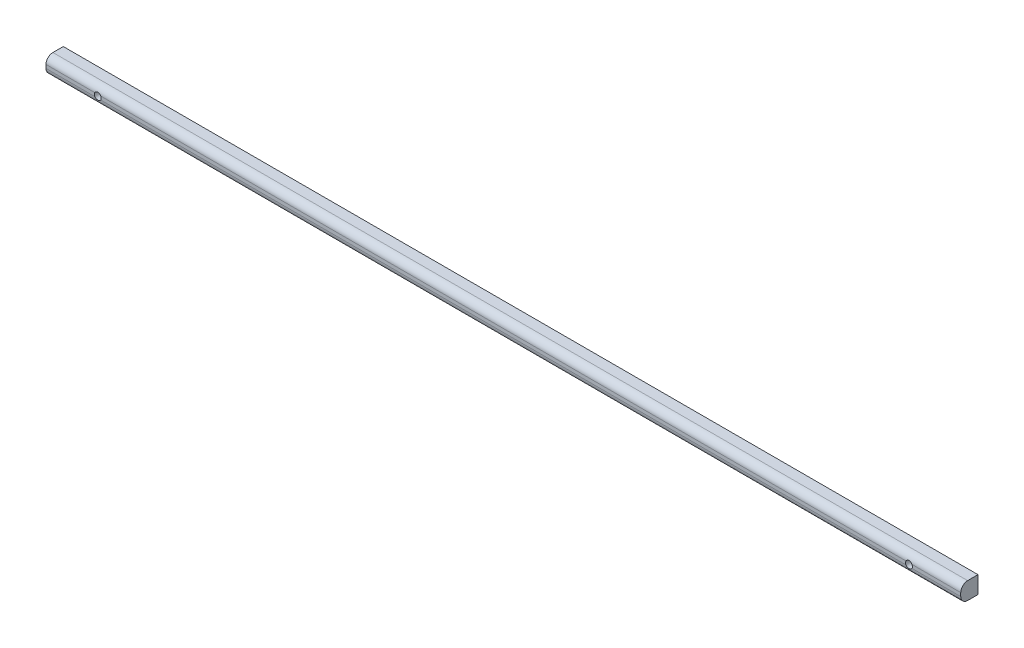
ISO-10303-21;
HEADER;
FILE_DESCRIPTION(('STEP AP214'),'2;1');
FILE_NAME('part.step','',(''),(''),'','','');
FILE_SCHEMA(('AUTOMOTIVE_DESIGN { 1 0 10303 214 1 1 1 1 }'));
ENDSEC;
DATA;
#1=APPLICATION_CONTEXT('core data for automotive mechanical design processes');
#2=APPLICATION_PROTOCOL_DEFINITION('international standard','automotive_design',2000,#1);
#3=PRODUCT_CONTEXT('',#1,'mechanical');
#4=PRODUCT('Part','Part','',(#3));
#5=PRODUCT_RELATED_PRODUCT_CATEGORY('part','',(#4));
#6=PRODUCT_DEFINITION_FORMATION('','',#4);
#7=PRODUCT_DEFINITION_CONTEXT('part definition',#1,'design');
#8=PRODUCT_DEFINITION('design','',#6,#7);
#9=PRODUCT_DEFINITION_SHAPE('','',#8);
#10=(LENGTH_UNIT() NAMED_UNIT(*) SI_UNIT(.MILLI.,.METRE.));
#11=(NAMED_UNIT(*) PLANE_ANGLE_UNIT() SI_UNIT($,.RADIAN.));
#12=(NAMED_UNIT(*) SI_UNIT($,.STERADIAN.) SOLID_ANGLE_UNIT());
#13=UNCERTAINTY_MEASURE_WITH_UNIT(LENGTH_MEASURE(1.E-05),#10,'distance_accuracy_value','');
#14=(GEOMETRIC_REPRESENTATION_CONTEXT(3) GLOBAL_UNCERTAINTY_ASSIGNED_CONTEXT((#13)) GLOBAL_UNIT_ASSIGNED_CONTEXT((#10,
#11,#12)) REPRESENTATION_CONTEXT('',''));
#15=CARTESIAN_POINT('',(0.,0.,0.));
#16=DIRECTION('',(0.,0.,1.));
#17=DIRECTION('',(1.,0.,0.));
#18=AXIS2_PLACEMENT_3D('',#15,#16,#17);
#19=CARTESIAN_POINT('',(0.,0.,5.));
#20=DIRECTION('',(0.,0.,1.));
#21=DIRECTION('',(1.,0.,0.));
#22=AXIS2_PLACEMENT_3D('',#19,#20,#21);
#23=PLANE('',#22);
#24=DIRECTION('',(0.,-1.,0.));
#25=VECTOR('',#24,1.);
#26=CARTESIAN_POINT('',(-265.,0.,5.));
#27=LINE('',#26,#25);
#28=CARTESIAN_POINT('',(-265.,3.,5.));
#29=VERTEX_POINT('',#28);
#30=CARTESIAN_POINT('',(-265.,2.,5.));
#31=VERTEX_POINT('',#30);
#32=EDGE_CURVE('E142',#29,#31,#27,.T.);
#33=ORIENTED_EDGE('',*,*,#32,.T.);
#34=DIRECTION('',(1.,0.,0.));
#35=VECTOR('',#34,1.);
#36=CARTESIAN_POINT('',(0.,2.,5.));
#37=LINE('',#36,#35);
#38=CARTESIAN_POINT('',(-250.866025403784,2.,5.));
#39=VERTEX_POINT('',#38);
#40=EDGE_CURVE('E163',#31,#39,#37,.T.);
#41=ORIENTED_EDGE('',*,*,#40,.T.);
#42=CARTESIAN_POINT('',(-250.,2.5,5.));
#43=DIRECTION('',(0.,0.,1.));
#44=DIRECTION('',(1.,0.,0.));
#45=AXIS2_PLACEMENT_3D('',#42,#43,#44);
#46=CIRCLE('',#45,0.999999999999998);
#47=CARTESIAN_POINT('',(-250.866025403784,3.00000000000001,5.));
#48=VERTEX_POINT('',#47);
#49=EDGE_CURVE('E139',#48,#39,#46,.T.);
#50=ORIENTED_EDGE('',*,*,#49,.F.);
#51=DIRECTION('',(-1.,0.,0.));
#52=VECTOR('',#51,1.);
#53=CARTESIAN_POINT('',(-265.,3.,5.));
#54=LINE('',#53,#52);
#55=EDGE_CURVE('E121',#48,#29,#54,.T.);
#56=ORIENTED_EDGE('',*,*,#55,.T.);
#57=EDGE_LOOP('',(#33,#41,#50,#56));
#58=FACE_BOUND('',#57,.T.);
#59=ADVANCED_FACE('F33',(#58),#23,.T.);
#60=CARTESIAN_POINT('',(-249.133974596216,2.,5.));
#61=VERTEX_POINT('',#60);
#62=CARTESIAN_POINT('',(-249.133974596216,3.,5.));
#63=VERTEX_POINT('',#62);
#64=EDGE_CURVE('E259',#61,#63,#46,.T.);
#65=ORIENTED_EDGE('',*,*,#64,.F.);
#66=DIRECTION('',(1.,0.,0.));
#67=VECTOR('',#66,1.);
#68=CARTESIAN_POINT('',(0.,2.,5.));
#69=LINE('',#68,#67);
#70=CARTESIAN_POINT('',(-15.8660254037844,2.,5.));
#71=VERTEX_POINT('',#70);
#72=EDGE_CURVE('E161',#61,#71,#69,.T.);
#73=ORIENTED_EDGE('',*,*,#72,.T.);
#74=CARTESIAN_POINT('',(-15.,2.5,5.));
#75=DIRECTION('',(0.,0.,1.));
#76=DIRECTION('',(-1.,0.,0.));
#77=AXIS2_PLACEMENT_3D('',#74,#75,#76);
#78=CIRCLE('',#77,0.999999999999998);
#79=CARTESIAN_POINT('',(-15.8660254037844,3.00000000000006,5.));
#80=VERTEX_POINT('',#79);
#81=EDGE_CURVE('E251',#80,#71,#78,.T.);
#82=ORIENTED_EDGE('',*,*,#81,.F.);
#83=DIRECTION('',(-1.,0.,0.));
#84=VECTOR('',#83,1.);
#85=CARTESIAN_POINT('',(-265.,3.,5.));
#86=LINE('',#85,#84);
#87=EDGE_CURVE('E154',#80,#63,#86,.T.);
#88=ORIENTED_EDGE('',*,*,#87,.T.);
#89=EDGE_LOOP('',(#65,#73,#82,#88));
#90=FACE_BOUND('',#89,.T.);
#91=ADVANCED_FACE('F215',(#90),#23,.T.);
#92=CARTESIAN_POINT('',(0.,0.,5.));
#93=DIRECTION('',(-1.,0.,0.));
#94=DIRECTION('',(0.,-1.,0.));
#95=AXIS2_PLACEMENT_3D('',#92,#93,#94);
#96=PLANE('',#95);
#97=DIRECTION('',(0.,1.,0.));
#98=VECTOR('',#97,1.);
#99=CARTESIAN_POINT('',(0.,0.,5.));
#100=LINE('',#99,#98);
#101=CARTESIAN_POINT('',(0.,2.,5.));
#102=VERTEX_POINT('',#101);
#103=CARTESIAN_POINT('',(0.,3.00000000000006,5.));
#104=VERTEX_POINT('',#103);
#105=EDGE_CURVE('E148',#102,#104,#100,.T.);
#106=ORIENTED_EDGE('',*,*,#105,.F.);
#107=CARTESIAN_POINT('',(0.,2.,3.));
#108=DIRECTION('',(-1.,0.,0.));
#109=DIRECTION('',(0.,-1.,0.));
#110=AXIS2_PLACEMENT_3D('',#107,#108,#109);
#111=CIRCLE('',#110,2.);
#112=CARTESIAN_POINT('',(0.,0.,3.));
#113=VERTEX_POINT('',#112);
#114=EDGE_CURVE('E267',#102,#113,#111,.F.);
#115=ORIENTED_EDGE('',*,*,#114,.T.);
#116=DIRECTION('',(0.,0.,-1.));
#117=VECTOR('',#116,1.);
#118=CARTESIAN_POINT('',(0.,0.,5.));
#119=LINE('',#118,#117);
#120=CARTESIAN_POINT('',(0.,0.,0.));
#121=VERTEX_POINT('',#120);
#122=EDGE_CURVE('E134',#113,#121,#119,.T.);
#123=ORIENTED_EDGE('',*,*,#122,.T.);
#124=DIRECTION('',(0.,1.,0.));
#125=VECTOR('',#124,1.);
#126=CARTESIAN_POINT('',(0.,0.,0.));
#127=LINE('',#126,#125);
#128=CARTESIAN_POINT('',(0.,5.00000000000006,0.));
#129=VERTEX_POINT('',#128);
#130=EDGE_CURVE('E128',#121,#129,#127,.T.);
#131=ORIENTED_EDGE('',*,*,#130,.T.);
#132=DIRECTION('',(0.,0.,-1.));
#133=VECTOR('',#132,1.);
#134=CARTESIAN_POINT('',(0.,5.00000000000006,5.));
#135=LINE('',#134,#133);
#136=CARTESIAN_POINT('',(0.,5.00000000000006,3.));
#137=VERTEX_POINT('',#136);
#138=EDGE_CURVE('E112',#137,#129,#135,.T.);
#139=ORIENTED_EDGE('',*,*,#138,.F.);
#140=CARTESIAN_POINT('',(0.,3.00000000000006,3.));
#141=DIRECTION('',(-1.,0.,0.));
#142=DIRECTION('',(0.,-1.,0.));
#143=AXIS2_PLACEMENT_3D('',#140,#141,#142);
#144=CIRCLE('',#143,2.);
#145=EDGE_CURVE('E206',#137,#104,#144,.F.);
#146=ORIENTED_EDGE('',*,*,#145,.T.);
#147=EDGE_LOOP('',(#106,#115,#123,#131,#139,#146));
#148=FACE_BOUND('',#147,.T.);
#149=ADVANCED_FACE('F133',(#148),#96,.F.);
#150=CARTESIAN_POINT('',(0.,5.00000000000006,5.));
#151=DIRECTION('',(0.,-1.,0.));
#152=DIRECTION('',(1.,0.,0.));
#153=AXIS2_PLACEMENT_3D('',#150,#151,#152);
#154=PLANE('',#153);
#155=DIRECTION('',(0.,0.,-1.));
#156=VECTOR('',#155,1.);
#157=CARTESIAN_POINT('',(-265.,5.,5.));
#158=LINE('',#157,#156);
#159=CARTESIAN_POINT('',(-265.,5.,3.));
#160=VERTEX_POINT('',#159);
#161=CARTESIAN_POINT('',(-265.,5.,0.));
#162=VERTEX_POINT('',#161);
#163=EDGE_CURVE('E122',#160,#162,#158,.T.);
#164=ORIENTED_EDGE('',*,*,#163,.F.);
#165=DIRECTION('',(-1.,0.,0.));
#166=VECTOR('',#165,1.);
#167=CARTESIAN_POINT('',(0.,5.00000000000006,3.));
#168=LINE('',#167,#166);
#169=EDGE_CURVE('E11',#160,#137,#168,.F.);
#170=ORIENTED_EDGE('',*,*,#169,.T.);
#171=ORIENTED_EDGE('',*,*,#138,.T.);
#172=DIRECTION('',(-1.,0.,0.));
#173=VECTOR('',#172,1.);
#174=CARTESIAN_POINT('',(0.,5.00000000000006,0.));
#175=LINE('',#174,#173);
#176=EDGE_CURVE('E115',#129,#162,#175,.T.);
#177=ORIENTED_EDGE('',*,*,#176,.T.);
#178=EDGE_LOOP('',(#164,#170,#171,#177));
#179=FACE_BOUND('',#178,.T.);
#180=ADVANCED_FACE('F114',(#179),#154,.F.);
#181=CARTESIAN_POINT('',(-265.,0.,5.));
#182=DIRECTION('',(1.,0.,0.));
#183=DIRECTION('',(0.,0.,-1.));
#184=AXIS2_PLACEMENT_3D('',#181,#182,#183);
#185=PLANE('',#184);
#186=DIRECTION('',(0.,0.,-1.));
#187=VECTOR('',#186,1.);
#188=CARTESIAN_POINT('',(-265.,0.,5.));
#189=LINE('',#188,#187);
#190=CARTESIAN_POINT('',(-265.,0.,3.));
#191=VERTEX_POINT('',#190);
#192=CARTESIAN_POINT('',(-265.,0.,0.));
#193=VERTEX_POINT('',#192);
#194=EDGE_CURVE('E150',#191,#193,#189,.T.);
#195=ORIENTED_EDGE('',*,*,#194,.F.);
#196=CARTESIAN_POINT('',(-265.,2.,3.));
#197=DIRECTION('',(1.,0.,0.));
#198=DIRECTION('',(0.,0.,-1.));
#199=AXIS2_PLACEMENT_3D('',#196,#197,#198);
#200=CIRCLE('',#199,2.);
#201=EDGE_CURVE('E42',#191,#31,#200,.F.);
#202=ORIENTED_EDGE('',*,*,#201,.T.);
#203=ORIENTED_EDGE('',*,*,#32,.F.);
#204=CARTESIAN_POINT('',(-265.,3.,3.));
#205=DIRECTION('',(1.,0.,0.));
#206=DIRECTION('',(0.,0.,-1.));
#207=AXIS2_PLACEMENT_3D('',#204,#205,#206);
#208=CIRCLE('',#207,2.);
#209=EDGE_CURVE('E49',#29,#160,#208,.F.);
#210=ORIENTED_EDGE('',*,*,#209,.T.);
#211=ORIENTED_EDGE('',*,*,#163,.T.);
#212=DIRECTION('',(0.,-1.,0.));
#213=VECTOR('',#212,1.);
#214=CARTESIAN_POINT('',(-265.,0.,0.));
#215=LINE('',#214,#213);
#216=EDGE_CURVE('E130',#162,#193,#215,.T.);
#217=ORIENTED_EDGE('',*,*,#216,.T.);
#218=EDGE_LOOP('',(#195,#202,#203,#210,#211,#217));
#219=FACE_BOUND('',#218,.T.);
#220=ADVANCED_FACE('F218',(#219),#185,.F.);
#221=CARTESIAN_POINT('',(0.,0.,5.));
#222=DIRECTION('',(0.,1.,0.));
#223=DIRECTION('',(0.,0.,1.));
#224=AXIS2_PLACEMENT_3D('',#221,#222,#223);
#225=PLANE('',#224);
#226=ORIENTED_EDGE('',*,*,#122,.F.);
#227=DIRECTION('',(1.,0.,0.));
#228=VECTOR('',#227,1.);
#229=CARTESIAN_POINT('',(-265.,0.,3.));
#230=LINE('',#229,#228);
#231=EDGE_CURVE('E57',#113,#191,#230,.F.);
#232=ORIENTED_EDGE('',*,*,#231,.T.);
#233=ORIENTED_EDGE('',*,*,#194,.T.);
#234=DIRECTION('',(1.,0.,0.));
#235=VECTOR('',#234,1.);
#236=CARTESIAN_POINT('',(0.,0.,0.));
#237=LINE('',#236,#235);
#238=EDGE_CURVE('E146',#193,#121,#237,.T.);
#239=ORIENTED_EDGE('',*,*,#238,.T.);
#240=EDGE_LOOP('',(#226,#232,#233,#239));
#241=FACE_BOUND('',#240,.T.);
#242=ADVANCED_FACE('F221',(#241),#225,.F.);
#243=CARTESIAN_POINT('',(-14.1339745962156,2.,5.));
#244=VERTEX_POINT('',#243);
#245=CARTESIAN_POINT('',(-14.1339745962156,3.00000000000006,5.));
#246=VERTEX_POINT('',#245);
#247=EDGE_CURVE('E253',#244,#246,#78,.T.);
#248=ORIENTED_EDGE('',*,*,#247,.F.);
#249=DIRECTION('',(1.,0.,0.));
#250=VECTOR('',#249,1.);
#251=CARTESIAN_POINT('',(0.,2.,5.));
#252=LINE('',#251,#250);
#253=EDGE_CURVE('E159',#244,#102,#252,.T.);
#254=ORIENTED_EDGE('',*,*,#253,.T.);
#255=ORIENTED_EDGE('',*,*,#105,.T.);
#256=DIRECTION('',(-1.,0.,0.));
#257=VECTOR('',#256,1.);
#258=CARTESIAN_POINT('',(-265.,3.,5.));
#259=LINE('',#258,#257);
#260=EDGE_CURVE('E156',#104,#246,#259,.T.);
#261=ORIENTED_EDGE('',*,*,#260,.T.);
#262=EDGE_LOOP('',(#248,#254,#255,#261));
#263=FACE_BOUND('',#262,.T.);
#264=ADVANCED_FACE('F191',(#263),#23,.T.);
#265=CARTESIAN_POINT('',(0.,0.,0.));
#266=DIRECTION('',(0.,0.,1.));
#267=DIRECTION('',(1.,0.,0.));
#268=AXIS2_PLACEMENT_3D('',#265,#266,#267);
#269=PLANE('',#268);
#270=CARTESIAN_POINT('',(-250.,2.5,0.));
#271=DIRECTION('',(0.,0.,1.));
#272=DIRECTION('',(1.,0.,0.));
#273=AXIS2_PLACEMENT_3D('',#270,#271,#272);
#274=CIRCLE('',#273,0.999999999999998);
#275=CARTESIAN_POINT('',(-249.,2.5,0.));
#276=VERTEX_POINT('',#275);
#277=EDGE_CURVE('E136',#276,#276,#274,.T.);
#278=ORIENTED_EDGE('',*,*,#277,.T.);
#279=EDGE_LOOP('',(#278));
#280=FACE_BOUND('',#279,.T.);
#281=CARTESIAN_POINT('',(-15.,2.5,0.));
#282=DIRECTION('',(0.,0.,1.));
#283=DIRECTION('',(-1.,0.,0.));
#284=AXIS2_PLACEMENT_3D('',#281,#282,#283);
#285=CIRCLE('',#284,0.999999999999998);
#286=CARTESIAN_POINT('',(-16.,2.5,0.));
#287=VERTEX_POINT('',#286);
#288=EDGE_CURVE('E261',#287,#287,#285,.T.);
#289=ORIENTED_EDGE('',*,*,#288,.T.);
#290=EDGE_LOOP('',(#289));
#291=FACE_BOUND('',#290,.T.);
#292=ORIENTED_EDGE('',*,*,#130,.F.);
#293=ORIENTED_EDGE('',*,*,#238,.F.);
#294=ORIENTED_EDGE('',*,*,#216,.F.);
#295=ORIENTED_EDGE('',*,*,#176,.F.);
#296=EDGE_LOOP('',(#292,#293,#294,#295));
#297=FACE_BOUND('',#296,.T.);
#298=ADVANCED_FACE('F126',(#280,#291,#297),#269,.F.);
#299=CARTESIAN_POINT('',(-15.,2.5,0.));
#300=DIRECTION('',(0.,0.,1.));
#301=DIRECTION('',(1.,0.,0.));
#302=AXIS2_PLACEMENT_3D('',#299,#300,#301);
#303=CYLINDRICAL_SURFACE('',#302,0.999999999999998);
#304=ORIENTED_EDGE('',*,*,#288,.F.);
#305=EDGE_LOOP('',(#304));
#306=FACE_BOUND('',#305,.T.);
#307=ORIENTED_EDGE('',*,*,#81,.T.);
#308=CARTESIAN_POINT('',(-15.8660254037844,2.,5.));
#309=CARTESIAN_POINT('',(-15.8382789768546,1.95185227764793,5.00002160448696));
#310=CARTESIAN_POINT('',(-15.8064871912116,1.90613395757678,4.9982611006868));
#311=CARTESIAN_POINT('',(-15.7359486237809,1.82072352783093,4.99240215979366));
#312=CARTESIAN_POINT('',(-15.6972151496485,1.78102015127064,4.98830816397004));
#313=CARTESIAN_POINT('',(-15.613852579924,1.70864829710596,4.97900348113971));
#314=CARTESIAN_POINT('',(-15.5692287522125,1.67597360145387,4.97379378936479));
#315=CARTESIAN_POINT('',(-15.4751933161187,1.61839380558249,4.96347463480097));
#316=CARTESIAN_POINT('',(-15.4257803636663,1.59349089484184,4.95836520063601));
#317=CARTESIAN_POINT('',(-15.3222371748292,1.55165834119095,4.94922108745151));
#318=CARTESIAN_POINT('',(-15.2680242721165,1.53492641039869,4.94521399637359));
#319=CARTESIAN_POINT('',(-15.1574445507987,1.51085346851686,4.93930192795804));
#320=CARTESIAN_POINT('',(-15.1010782533353,1.50351019992515,4.93739644530418));
#321=CARTESIAN_POINT('',(-14.9893053722833,1.49853264791498,4.9361137900508));
#322=CARTESIAN_POINT('',(-14.9339100247218,1.50066022972161,4.93667460070773));
#323=CARTESIAN_POINT('',(-14.824304464944,1.51400862233837,4.94006662473355));
#324=CARTESIAN_POINT('',(-14.7700941902228,1.52522895237063,4.94289771806147));
#325=CARTESIAN_POINT('',(-14.6648661712682,1.55624806408707,4.95021358301255));
#326=CARTESIAN_POINT('',(-14.6138234779861,1.57596630815883,4.95468277181757));
#327=CARTESIAN_POINT('',(-14.515654142598,1.62342524243616,4.96437656792398));
#328=CARTESIAN_POINT('',(-14.4685302055152,1.65117141591205,4.96960169032262));
#329=CARTESIAN_POINT('',(-14.3779944147547,1.71496884755903,4.97985685570814));
#330=CARTESIAN_POINT('',(-14.3347463670715,1.75125429921404,4.98487555991235));
#331=CARTESIAN_POINT('',(-14.2549395228805,1.83064339175183,4.99321324061156));
#332=CARTESIAN_POINT('',(-14.2183666063676,1.87373227224911,4.9965358323314));
#333=CARTESIAN_POINT('',(-14.1764337744393,1.93255408048018,4.99890507663899));
#334=CARTESIAN_POINT('',(-14.1674870150835,1.94576407210951,4.99930967311953));
#335=CARTESIAN_POINT('',(-14.1502436579446,1.97258445261014,4.99985686990988));
#336=CARTESIAN_POINT('',(-14.1419462886262,1.98619433907784,4.99999978578667));
#337=CARTESIAN_POINT('',(-14.1339745962156,2.,5.));
#338=B_SPLINE_CURVE_WITH_KNOTS('',3,(#308,#309,#310,#311,#312,#313,#314,#315,#316,#317,#318,
#319,#320,#321,#322,#323,#324,#325,#326,#327,#328,#329,#330,#331,#332,#333,#334,#335,#336,#337),
.UNSPECIFIED.,.F.,.F.,(4,2,2,2,2,2,2,2,2,2,2,2,2,2,4),(0.,0.1663713171757,0.332427036865248,
0.49833524267882,0.664290146290105,0.834082994907157,1.00383500918157,1.16934322876031,
1.33484269768488,1.49880702271496,1.66288360480053,1.83213146346234,2.00101705191385,
2.04888216733833,2.09668952294701),.UNSPECIFIED.);
#339=EDGE_CURVE('E200',#71,#244,#338,.T.);
#340=ORIENTED_EDGE('',*,*,#339,.T.);
#341=ORIENTED_EDGE('',*,*,#247,.T.);
#342=CARTESIAN_POINT('',(-14.1339745962156,3.00000000000006,5.));
#343=CARTESIAN_POINT('',(-14.1617210231455,3.04814772235213,5.00002160448696));
#344=CARTESIAN_POINT('',(-14.1935128087885,3.09386604242327,4.9982611006868));
#345=CARTESIAN_POINT('',(-14.2640513762192,3.17927647216912,4.99240215979366));
#346=CARTESIAN_POINT('',(-14.3027848503516,3.2189798487294,4.98830816397004));
#347=CARTESIAN_POINT('',(-14.3861474200761,3.29135170289408,4.97900348113971));
#348=CARTESIAN_POINT('',(-14.4307712477876,3.32402639854617,4.9737937893648));
#349=CARTESIAN_POINT('',(-14.5248066838813,3.38160619441754,4.96347463480097));
#350=CARTESIAN_POINT('',(-14.5742196363338,3.40650910515819,4.95836520063602));
#351=CARTESIAN_POINT('',(-14.6777628251709,3.44834165880907,4.94922108745151));
#352=CARTESIAN_POINT('',(-14.7319757278836,3.46507358960133,4.9452139963736));
#353=CARTESIAN_POINT('',(-14.8425554492014,3.48914653148316,4.93930192795805));
#354=CARTESIAN_POINT('',(-14.8989217466648,3.49648980007486,4.93739644530419));
#355=CARTESIAN_POINT('',(-15.0106946277168,3.50146735208502,4.93611379005082));
#356=CARTESIAN_POINT('',(-15.0660899752783,3.49933977027839,4.93667460070774));
#357=CARTESIAN_POINT('',(-15.1756955350561,3.48599137766163,4.94006662473356));
#358=CARTESIAN_POINT('',(-15.2299058097773,3.47477104762936,4.94289771806149));
#359=CARTESIAN_POINT('',(-15.3351338287319,3.44375193591292,4.95021358301256));
#360=CARTESIAN_POINT('',(-15.386176522014,3.42403369184115,4.95468277181758));
#361=CARTESIAN_POINT('',(-15.4843458574021,3.37657475756381,4.96437656792399));
#362=CARTESIAN_POINT('',(-15.5314697944849,3.34882858408792,4.96960169032263));
#363=CARTESIAN_POINT('',(-15.6220055852454,3.28503115244093,4.97985685570815));
#364=CARTESIAN_POINT('',(-15.6652536329286,3.24874570078592,4.98487555991237));
#365=CARTESIAN_POINT('',(-15.7450604771195,3.16935660824812,4.99321324061157));
#366=CARTESIAN_POINT('',(-15.7816333936325,3.12626772775084,4.99653583233141));
#367=CARTESIAN_POINT('',(-15.8235662255607,3.06744591951979,4.998905076639));
#368=CARTESIAN_POINT('',(-15.8325129849166,3.05423592789048,4.99930967311953));
#369=CARTESIAN_POINT('',(-15.8497563420555,3.02741554738988,4.99985686990988));
#370=CARTESIAN_POINT('',(-15.8580537113738,3.0138056609222,4.99999978578667));
#371=CARTESIAN_POINT('',(-15.8660254037844,3.00000000000006,5.));
#372=B_SPLINE_CURVE_WITH_KNOTS('',3,(#342,#343,#344,#345,#346,#347,#348,#349,#350,#351,#352,
#353,#354,#355,#356,#357,#358,#359,#360,#361,#362,#363,#364,#365,#366,#367,#368,#369,#370,#371),
.UNSPECIFIED.,.F.,.F.,(4,2,2,2,2,2,2,2,2,2,2,2,2,2,4),(0.,0.166371317175701,0.332427036865249,
0.49833524267882,0.664290146290107,0.834082994907159,1.00383500918157,1.16934322876031,
1.33484269768488,1.49880702271497,1.66288360480054,1.83213146346235,2.00101705191385,
2.04888216733827,2.09668952294689),.UNSPECIFIED.);
#373=EDGE_CURVE('E194',#246,#80,#372,.T.);
#374=ORIENTED_EDGE('',*,*,#373,.T.);
#375=EDGE_LOOP('',(#307,#340,#341,#374));
#376=FACE_BOUND('',#375,.T.);
#377=ADVANCED_FACE('F184',(#306,#376),#303,.F.);
#378=CARTESIAN_POINT('',(-250.,2.5,0.));
#379=DIRECTION('',(0.,0.,1.));
#380=DIRECTION('',(1.,0.,0.));
#381=AXIS2_PLACEMENT_3D('',#378,#379,#380);
#382=CYLINDRICAL_SURFACE('',#381,0.999999999999998);
#383=ORIENTED_EDGE('',*,*,#277,.F.);
#384=EDGE_LOOP('',(#383));
#385=FACE_BOUND('',#384,.T.);
#386=ORIENTED_EDGE('',*,*,#49,.T.);
#387=CARTESIAN_POINT('',(-250.866025403784,2.,5.));
#388=CARTESIAN_POINT('',(-250.838278976855,1.95185227764793,5.00002160448696));
#389=CARTESIAN_POINT('',(-250.806487191212,1.90613395757678,4.9982611006868));
#390=CARTESIAN_POINT('',(-250.735948623781,1.82072352783093,4.99240215979365));
#391=CARTESIAN_POINT('',(-250.697215149648,1.78102015127064,4.98830816397004));
#392=CARTESIAN_POINT('',(-250.613852579924,1.70864829710596,4.97900348113971));
#393=CARTESIAN_POINT('',(-250.569228752212,1.67597360145387,4.97379378936479));
#394=CARTESIAN_POINT('',(-250.475193316119,1.61839380558249,4.96347463480097));
#395=CARTESIAN_POINT('',(-250.425780363666,1.59349089484183,4.95836520063601));
#396=CARTESIAN_POINT('',(-250.322237174829,1.55165834119094,4.9492210874515));
#397=CARTESIAN_POINT('',(-250.268024272116,1.53492641039868,4.94521399637359));
#398=CARTESIAN_POINT('',(-250.157444550799,1.51085346851685,4.93930192795803));
#399=CARTESIAN_POINT('',(-250.101078253335,1.50351019992514,4.93739644530418));
#400=CARTESIAN_POINT('',(-249.989305372283,1.49853264791499,4.9361137900508));
#401=CARTESIAN_POINT('',(-249.933910024722,1.50066022972162,4.93667460070772));
#402=CARTESIAN_POINT('',(-249.824304464944,1.51400862233837,4.94006662473355));
#403=CARTESIAN_POINT('',(-249.770094190223,1.52522895237064,4.94289771806147));
#404=CARTESIAN_POINT('',(-249.664866171268,1.55624806408708,4.95021358301255));
#405=CARTESIAN_POINT('',(-249.613823477986,1.57596630815884,4.95468277181757));
#406=CARTESIAN_POINT('',(-249.515654142598,1.62342524243619,4.96437656792398));
#407=CARTESIAN_POINT('',(-249.468530205515,1.65117141591207,4.96960169032262));
#408=CARTESIAN_POINT('',(-249.377994414755,1.71496884755905,4.97985685570814));
#409=CARTESIAN_POINT('',(-249.334746367071,1.75125429921405,4.98487555991236));
#410=CARTESIAN_POINT('',(-249.254939522881,1.83064339175184,4.99321324061156));
#411=CARTESIAN_POINT('',(-249.218366606368,1.87373227224912,4.9965358323314));
#412=CARTESIAN_POINT('',(-249.176433774439,1.93255408048018,4.99890507663899));
#413=CARTESIAN_POINT('',(-249.167487015083,1.94576407210951,4.99930967311953));
#414=CARTESIAN_POINT('',(-249.150243657945,1.97258445261014,4.99985686990988));
#415=CARTESIAN_POINT('',(-249.141946288626,1.98619433907784,4.99999978578667));
#416=CARTESIAN_POINT('',(-249.133974596216,2.,5.));
#417=B_SPLINE_CURVE_WITH_KNOTS('',3,(#387,#388,#389,#390,#391,#392,#393,#394,#395,#396,#397,
#398,#399,#400,#401,#402,#403,#404,#405,#406,#407,#408,#409,#410,#411,#412,#413,#414,#415,#416),
.UNSPECIFIED.,.F.,.F.,(4,2,2,2,2,2,2,2,2,2,2,2,2,2,4),(0.,0.166371317175694,0.332427036865257,
0.498335242678835,0.664290146290171,0.834082994907199,1.0038350091816,1.16934322876034,
1.3348426976849,1.49880702271503,1.66288360480058,1.83213146346236,2.00101705191385,
2.04888216733832,2.09668952294702),.UNSPECIFIED.);
#418=EDGE_CURVE('E173',#39,#61,#417,.T.);
#419=ORIENTED_EDGE('',*,*,#418,.T.);
#420=ORIENTED_EDGE('',*,*,#64,.T.);
#421=CARTESIAN_POINT('',(-249.133974596216,3.00000000000001,5.));
#422=CARTESIAN_POINT('',(-249.161721023145,3.04814772235208,5.00002160448696));
#423=CARTESIAN_POINT('',(-249.193512808788,3.09386604242322,4.9982611006868));
#424=CARTESIAN_POINT('',(-249.264051376219,3.17927647216907,4.99240215979366));
#425=CARTESIAN_POINT('',(-249.302784850352,3.21897984872935,4.98830816397004));
#426=CARTESIAN_POINT('',(-249.386147420076,3.29135170289404,4.97900348113971));
#427=CARTESIAN_POINT('',(-249.430771247788,3.32402639854613,4.97379378936479));
#428=CARTESIAN_POINT('',(-249.524806683881,3.38160619441751,4.96347463480097));
#429=CARTESIAN_POINT('',(-249.574219636334,3.40650910515816,4.95836520063601));
#430=CARTESIAN_POINT('',(-249.677762825171,3.44834165880905,4.94922108745151));
#431=CARTESIAN_POINT('',(-249.731975727883,3.46507358960131,4.94521399637359));
#432=CARTESIAN_POINT('',(-249.842555449201,3.48914653148315,4.93930192795804));
#433=CARTESIAN_POINT('',(-249.898921746665,3.49648980007486,4.93739644530418));
#434=CARTESIAN_POINT('',(-250.010694627717,3.50146735208502,4.9361137900508));
#435=CARTESIAN_POINT('',(-250.066089975278,3.4993397702784,4.93667460070772));
#436=CARTESIAN_POINT('',(-250.175695535056,3.48599137766165,4.94006662473354));
#437=CARTESIAN_POINT('',(-250.229905809777,3.47477104762938,4.94289771806147));
#438=CARTESIAN_POINT('',(-250.335133828732,3.44375193591293,4.95021358301255));
#439=CARTESIAN_POINT('',(-250.386176522014,3.42403369184117,4.95468277181757));
#440=CARTESIAN_POINT('',(-250.484345857402,3.37657475756383,4.96437656792398));
#441=CARTESIAN_POINT('',(-250.531469794485,3.34882858408794,4.96960169032262));
#442=CARTESIAN_POINT('',(-250.622005585245,3.28503115244096,4.97985685570814));
#443=CARTESIAN_POINT('',(-250.665253632929,3.24874570078594,4.98487555991236));
#444=CARTESIAN_POINT('',(-250.745060477119,3.16935660824816,4.99321324061156));
#445=CARTESIAN_POINT('',(-250.781633393632,3.12626772775088,4.9965358323314));
#446=CARTESIAN_POINT('',(-250.823566225561,3.06744591951984,4.99890507663899));
#447=CARTESIAN_POINT('',(-250.832512984917,3.05423592789051,4.99930967311953));
#448=CARTESIAN_POINT('',(-250.849756342055,3.02741554738988,4.99985686990988));
#449=CARTESIAN_POINT('',(-250.858053711374,3.01380566092218,4.99999978578667));
#450=CARTESIAN_POINT('',(-250.866025403784,3.00000000000002,5.));
#451=B_SPLINE_CURVE_WITH_KNOTS('',3,(#421,#422,#423,#424,#425,#426,#427,#428,#429,#430,#431,
#432,#433,#434,#435,#436,#437,#438,#439,#440,#441,#442,#443,#444,#445,#446,#447,#448,#449,#450),
.UNSPECIFIED.,.F.,.F.,(4,2,2,2,2,2,2,2,2,2,2,2,2,2,4),(0.,0.166371317175687,0.332427036865245,
0.498335242678808,0.664290146290085,0.834082994907142,1.00383500918157,1.16934322876026,
1.33484269768485,1.49880702271497,1.66288360480058,1.83213146346239,2.00101705191387,
2.04888216733832,2.09668952294701),.UNSPECIFIED.);
#452=EDGE_CURVE('E166',#63,#48,#451,.T.);
#453=ORIENTED_EDGE('',*,*,#452,.T.);
#454=EDGE_LOOP('',(#386,#419,#420,#453));
#455=FACE_BOUND('',#454,.T.);
#456=ADVANCED_FACE('F179',(#385,#455),#382,.F.);
#457=CARTESIAN_POINT('',(0.,2.,3.));
#458=DIRECTION('',(-1.,0.,0.));
#459=DIRECTION('',(0.,0.,1.));
#460=AXIS2_PLACEMENT_3D('',#457,#458,#459);
#461=CYLINDRICAL_SURFACE('',#460,2.);
#462=ORIENTED_EDGE('',*,*,#201,.F.);
#463=ORIENTED_EDGE('',*,*,#231,.F.);
#464=ORIENTED_EDGE('',*,*,#114,.F.);
#465=ORIENTED_EDGE('',*,*,#253,.F.);
#466=ORIENTED_EDGE('',*,*,#339,.F.);
#467=ORIENTED_EDGE('',*,*,#72,.F.);
#468=ORIENTED_EDGE('',*,*,#418,.F.);
#469=ORIENTED_EDGE('',*,*,#40,.F.);
#470=EDGE_LOOP('',(#462,#463,#464,#465,#466,#467,#468,#469));
#471=FACE_BOUND('',#470,.T.);
#472=ADVANCED_FACE('F183',(#471),#461,.T.);
#473=CARTESIAN_POINT('',(0.,3.00000000000006,3.));
#474=DIRECTION('',(1.,0.,0.));
#475=DIRECTION('',(0.,1.,0.));
#476=AXIS2_PLACEMENT_3D('',#473,#474,#475);
#477=CYLINDRICAL_SURFACE('',#476,2.);
#478=ORIENTED_EDGE('',*,*,#145,.F.);
#479=ORIENTED_EDGE('',*,*,#169,.F.);
#480=ORIENTED_EDGE('',*,*,#209,.F.);
#481=ORIENTED_EDGE('',*,*,#55,.F.);
#482=ORIENTED_EDGE('',*,*,#452,.F.);
#483=ORIENTED_EDGE('',*,*,#87,.F.);
#484=ORIENTED_EDGE('',*,*,#373,.F.);
#485=ORIENTED_EDGE('',*,*,#260,.F.);
#486=EDGE_LOOP('',(#478,#479,#480,#481,#482,#483,#484,#485));
#487=FACE_BOUND('',#486,.T.);
#488=ADVANCED_FACE('F35',(#487),#477,.T.);
#489=CLOSED_SHELL('',(#59,#91,#149,#180,#220,#242,#264,#298,#377,#456,#472,#488));
#490=MANIFOLD_SOLID_BREP('B2',#489);
#491=ADVANCED_BREP_SHAPE_REPRESENTATION('',(#18,#490),#14);
#492=SHAPE_DEFINITION_REPRESENTATION(#9,#491);
ENDSEC;
END-ISO-10303-21;
